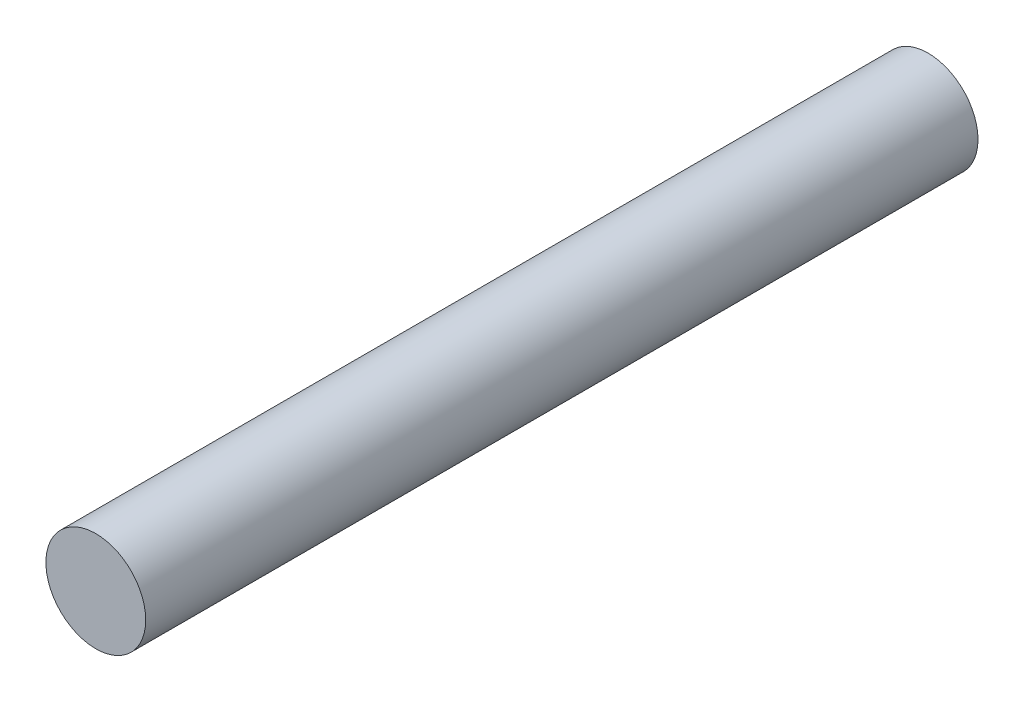
ISO-10303-21;
HEADER;
FILE_DESCRIPTION(('STEP AP214'),'2;1');
FILE_NAME('part.step','',(''),(''),'','','');
FILE_SCHEMA(('AUTOMOTIVE_DESIGN { 1 0 10303 214 1 1 1 1 }'));
ENDSEC;
DATA;
#1=APPLICATION_CONTEXT('core data for automotive mechanical design processes');
#2=APPLICATION_PROTOCOL_DEFINITION('international standard','automotive_design',2000,#1);
#3=PRODUCT_CONTEXT('',#1,'mechanical');
#4=PRODUCT('Part','Part','',(#3));
#5=PRODUCT_RELATED_PRODUCT_CATEGORY('part','',(#4));
#6=PRODUCT_DEFINITION_FORMATION('','',#4);
#7=PRODUCT_DEFINITION_CONTEXT('part definition',#1,'design');
#8=PRODUCT_DEFINITION('design','',#6,#7);
#9=PRODUCT_DEFINITION_SHAPE('','',#8);
#10=(LENGTH_UNIT() NAMED_UNIT(*) SI_UNIT(.MILLI.,.METRE.));
#11=(NAMED_UNIT(*) PLANE_ANGLE_UNIT() SI_UNIT($,.RADIAN.));
#12=(NAMED_UNIT(*) SI_UNIT($,.STERADIAN.) SOLID_ANGLE_UNIT());
#13=UNCERTAINTY_MEASURE_WITH_UNIT(LENGTH_MEASURE(1.E-05),#10,'distance_accuracy_value','');
#14=(GEOMETRIC_REPRESENTATION_CONTEXT(3) GLOBAL_UNCERTAINTY_ASSIGNED_CONTEXT((#13)) GLOBAL_UNIT_ASSIGNED_CONTEXT((#10,
#11,#12)) REPRESENTATION_CONTEXT('',''));
#15=CARTESIAN_POINT('',(0.,0.,0.));
#16=DIRECTION('',(0.,0.,1.));
#17=DIRECTION('',(1.,0.,0.));
#18=AXIS2_PLACEMENT_3D('',#15,#16,#17);
#19=CARTESIAN_POINT('',(0.,0.,50.038));
#20=DIRECTION('',(0.,0.,-1.));
#21=DIRECTION('',(-1.,0.,0.));
#22=AXIS2_PLACEMENT_3D('',#19,#20,#21);
#23=CYLINDRICAL_SURFACE('',#22,3.);
#24=CARTESIAN_POINT('',(0.,0.,50.038));
#25=DIRECTION('',(0.,0.,1.));
#26=DIRECTION('',(1.,0.,0.));
#27=AXIS2_PLACEMENT_3D('',#24,#25,#26);
#28=CIRCLE('',#27,3.);
#29=CARTESIAN_POINT('',(3.,0.,50.038));
#30=VERTEX_POINT('',#29);
#31=EDGE_CURVE('E10',#30,#30,#28,.T.);
#32=ORIENTED_EDGE('',*,*,#31,.F.);
#33=EDGE_LOOP('',(#32));
#34=FACE_BOUND('',#33,.T.);
#35=CARTESIAN_POINT('',(0.,0.,0.));
#36=DIRECTION('',(0.,0.,1.));
#37=DIRECTION('',(1.,0.,0.));
#38=AXIS2_PLACEMENT_3D('',#35,#36,#37);
#39=CIRCLE('',#38,3.);
#40=CARTESIAN_POINT('',(3.,0.,0.));
#41=VERTEX_POINT('',#40);
#42=EDGE_CURVE('E33',#41,#41,#39,.T.);
#43=ORIENTED_EDGE('',*,*,#42,.T.);
#44=EDGE_LOOP('',(#43));
#45=FACE_BOUND('',#44,.T.);
#46=ADVANCED_FACE('F30',(#34,#45),#23,.T.);
#47=CARTESIAN_POINT('',(0.,0.,50.038));
#48=DIRECTION('',(0.,0.,1.));
#49=DIRECTION('',(1.,0.,0.));
#50=AXIS2_PLACEMENT_3D('',#47,#48,#49);
#51=PLANE('',#50);
#52=ORIENTED_EDGE('',*,*,#31,.T.);
#53=EDGE_LOOP('',(#52));
#54=FACE_BOUND('',#53,.T.);
#55=ADVANCED_FACE('F45',(#54),#51,.T.);
#56=CARTESIAN_POINT('',(0.,0.,0.));
#57=DIRECTION('',(0.,0.,1.));
#58=DIRECTION('',(1.,0.,0.));
#59=AXIS2_PLACEMENT_3D('',#56,#57,#58);
#60=PLANE('',#59);
#61=ORIENTED_EDGE('',*,*,#42,.F.);
#62=EDGE_LOOP('',(#61));
#63=FACE_BOUND('',#62,.T.);
#64=ADVANCED_FACE('F43',(#63),#60,.F.);
#65=CLOSED_SHELL('',(#46,#55,#64));
#66=MANIFOLD_SOLID_BREP('B2',#65);
#67=ADVANCED_BREP_SHAPE_REPRESENTATION('',(#18,#66),#14);
#68=SHAPE_DEFINITION_REPRESENTATION(#9,#67);
ENDSEC;
END-ISO-10303-21;
